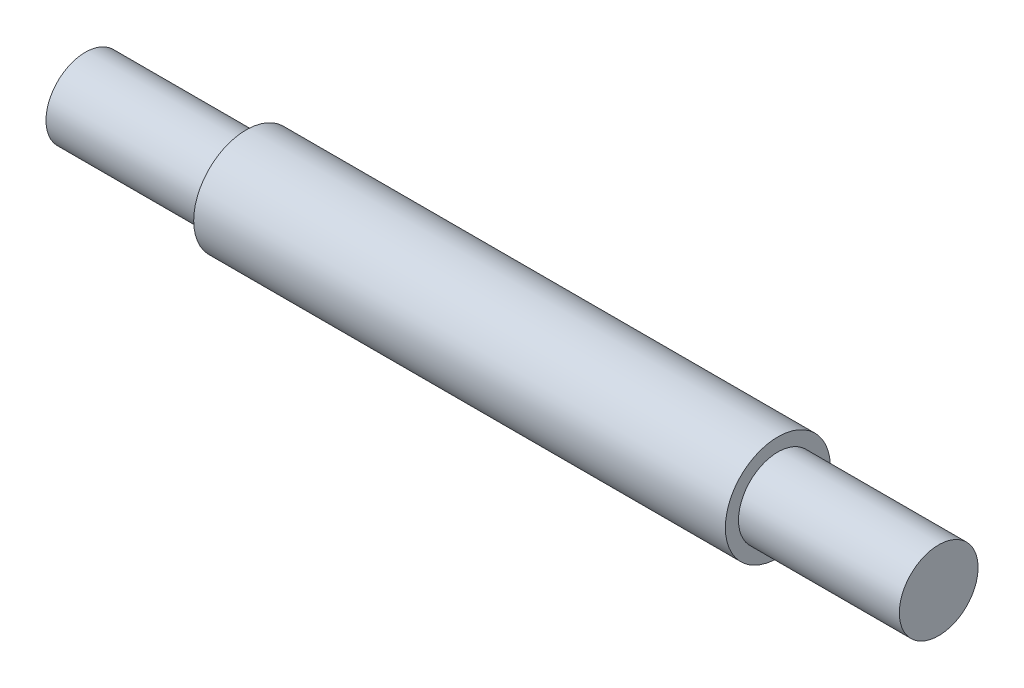
ISO-10303-21;
HEADER;
FILE_DESCRIPTION(('STEP AP214'),'2;1');
FILE_NAME('part.step','',(''),(''),'','','');
FILE_SCHEMA(('AUTOMOTIVE_DESIGN { 1 0 10303 214 1 1 1 1 }'));
ENDSEC;
DATA;
#1=APPLICATION_CONTEXT('core data for automotive mechanical design processes');
#2=APPLICATION_PROTOCOL_DEFINITION('international standard','automotive_design',2000,#1);
#3=PRODUCT_CONTEXT('',#1,'mechanical');
#4=PRODUCT('Part','Part','',(#3));
#5=PRODUCT_RELATED_PRODUCT_CATEGORY('part','',(#4));
#6=PRODUCT_DEFINITION_FORMATION('','',#4);
#7=PRODUCT_DEFINITION_CONTEXT('part definition',#1,'design');
#8=PRODUCT_DEFINITION('design','',#6,#7);
#9=PRODUCT_DEFINITION_SHAPE('','',#8);
#10=(LENGTH_UNIT() NAMED_UNIT(*) SI_UNIT(.MILLI.,.METRE.));
#11=(NAMED_UNIT(*) PLANE_ANGLE_UNIT() SI_UNIT($,.RADIAN.));
#12=(NAMED_UNIT(*) SI_UNIT($,.STERADIAN.) SOLID_ANGLE_UNIT());
#13=UNCERTAINTY_MEASURE_WITH_UNIT(LENGTH_MEASURE(1.E-05),#10,'distance_accuracy_value','');
#14=(GEOMETRIC_REPRESENTATION_CONTEXT(3) GLOBAL_UNCERTAINTY_ASSIGNED_CONTEXT((#13)) GLOBAL_UNIT_ASSIGNED_CONTEXT((#10,
#11,#12)) REPRESENTATION_CONTEXT('',''));
#15=CARTESIAN_POINT('',(0.,0.,0.));
#16=DIRECTION('',(0.,0.,1.));
#17=DIRECTION('',(1.,0.,0.));
#18=AXIS2_PLACEMENT_3D('',#15,#16,#17);
#19=CARTESIAN_POINT('',(-65.,0.,0.));
#20=DIRECTION('',(-1.,0.,0.));
#21=DIRECTION('',(0.,0.,1.));
#22=AXIS2_PLACEMENT_3D('',#19,#20,#21);
#23=CYLINDRICAL_SURFACE('',#22,8.);
#24=CARTESIAN_POINT('',(-40.5,0.,0.));
#25=DIRECTION('',(-1.,0.,0.));
#26=DIRECTION('',(0.,0.,1.));
#27=AXIS2_PLACEMENT_3D('',#24,#25,#26);
#28=CIRCLE('',#27,7.99999999999999);
#29=CARTESIAN_POINT('',(-40.5,0.,7.99999999999999));
#30=VERTEX_POINT('',#29);
#31=EDGE_CURVE('E10',#30,#30,#28,.T.);
#32=ORIENTED_EDGE('',*,*,#31,.F.);
#33=EDGE_LOOP('',(#32));
#34=FACE_BOUND('',#33,.T.);
#35=CARTESIAN_POINT('',(40.5,0.,0.));
#36=DIRECTION('',(-1.,0.,0.));
#37=DIRECTION('',(0.,0.,1.));
#38=AXIS2_PLACEMENT_3D('',#35,#36,#37);
#39=CIRCLE('',#38,7.99999999999999);
#40=CARTESIAN_POINT('',(40.5,0.,7.99999999999999));
#41=VERTEX_POINT('',#40);
#42=EDGE_CURVE('E45',#41,#41,#39,.T.);
#43=ORIENTED_EDGE('',*,*,#42,.T.);
#44=EDGE_LOOP('',(#43));
#45=FACE_BOUND('',#44,.T.);
#46=ADVANCED_FACE('F31',(#34,#45),#23,.T.);
#47=CARTESIAN_POINT('',(-40.5,7.99999999999999,0.));
#48=DIRECTION('',(1.,0.,0.));
#49=DIRECTION('',(0.,0.,-1.));
#50=AXIS2_PLACEMENT_3D('',#47,#48,#49);
#51=PLANE('',#50);
#52=CARTESIAN_POINT('',(-40.5,0.,0.));
#53=DIRECTION('',(-1.,0.,0.));
#54=DIRECTION('',(0.,0.,1.));
#55=AXIS2_PLACEMENT_3D('',#52,#53,#54);
#56=CIRCLE('',#55,6.);
#57=CARTESIAN_POINT('',(-40.5,0.,6.));
#58=VERTEX_POINT('',#57);
#59=EDGE_CURVE('E37',#58,#58,#56,.T.);
#60=ORIENTED_EDGE('',*,*,#59,.F.);
#61=EDGE_LOOP('',(#60));
#62=FACE_BOUND('',#61,.T.);
#63=ORIENTED_EDGE('',*,*,#31,.T.);
#64=EDGE_LOOP('',(#63));
#65=FACE_BOUND('',#64,.T.);
#66=ADVANCED_FACE('F69',(#62,#65),#51,.F.);
#67=CARTESIAN_POINT('',(-65.,0.,0.));
#68=DIRECTION('',(-1.,0.,0.));
#69=DIRECTION('',(0.,0.,1.));
#70=AXIS2_PLACEMENT_3D('',#67,#68,#69);
#71=CYLINDRICAL_SURFACE('',#70,6.);
#72=CARTESIAN_POINT('',(-65.,0.,0.));
#73=DIRECTION('',(-1.,0.,0.));
#74=DIRECTION('',(0.,0.,1.));
#75=AXIS2_PLACEMENT_3D('',#72,#73,#74);
#76=CIRCLE('',#75,6.);
#77=CARTESIAN_POINT('',(-65.,0.,6.));
#78=VERTEX_POINT('',#77);
#79=EDGE_CURVE('E41',#78,#78,#76,.T.);
#80=ORIENTED_EDGE('',*,*,#79,.F.);
#81=EDGE_LOOP('',(#80));
#82=FACE_BOUND('',#81,.T.);
#83=ORIENTED_EDGE('',*,*,#59,.T.);
#84=EDGE_LOOP('',(#83));
#85=FACE_BOUND('',#84,.T.);
#86=ADVANCED_FACE('F74',(#82,#85),#71,.T.);
#87=CARTESIAN_POINT('',(-65.,6.,0.));
#88=DIRECTION('',(1.,0.,0.));
#89=DIRECTION('',(0.,0.,-1.));
#90=AXIS2_PLACEMENT_3D('',#87,#88,#89);
#91=PLANE('',#90);
#92=ORIENTED_EDGE('',*,*,#79,.T.);
#93=EDGE_LOOP('',(#92));
#94=FACE_BOUND('',#93,.T.);
#95=ADVANCED_FACE('F80',(#94),#91,.F.);
#96=CARTESIAN_POINT('',(40.5,7.99999999999999,0.));
#97=DIRECTION('',(-1.,0.,0.));
#98=DIRECTION('',(0.,0.,-1.));
#99=AXIS2_PLACEMENT_3D('',#96,#97,#98);
#100=PLANE('',#99);
#101=CARTESIAN_POINT('',(40.5,0.,0.));
#102=DIRECTION('',(-1.,0.,0.));
#103=DIRECTION('',(0.,0.,1.));
#104=AXIS2_PLACEMENT_3D('',#101,#102,#103);
#105=CIRCLE('',#104,6.);
#106=CARTESIAN_POINT('',(40.5,0.,6.));
#107=VERTEX_POINT('',#106);
#108=EDGE_CURVE('E50',#107,#107,#105,.T.);
#109=ORIENTED_EDGE('',*,*,#108,.T.);
#110=EDGE_LOOP('',(#109));
#111=FACE_BOUND('',#110,.T.);
#112=ORIENTED_EDGE('',*,*,#42,.F.);
#113=EDGE_LOOP('',(#112));
#114=FACE_BOUND('',#113,.T.);
#115=ADVANCED_FACE('F66',(#111,#114),#100,.F.);
#116=CARTESIAN_POINT('',(65.,0.,0.));
#117=DIRECTION('',(1.,0.,0.));
#118=DIRECTION('',(0.,0.,1.));
#119=AXIS2_PLACEMENT_3D('',#116,#117,#118);
#120=CYLINDRICAL_SURFACE('',#119,6.);
#121=CARTESIAN_POINT('',(65.,0.,0.));
#122=DIRECTION('',(-1.,0.,0.));
#123=DIRECTION('',(0.,0.,1.));
#124=AXIS2_PLACEMENT_3D('',#121,#122,#123);
#125=CIRCLE('',#124,6.);
#126=CARTESIAN_POINT('',(65.,0.,6.));
#127=VERTEX_POINT('',#126);
#128=EDGE_CURVE('E53',#127,#127,#125,.T.);
#129=ORIENTED_EDGE('',*,*,#128,.T.);
#130=EDGE_LOOP('',(#129));
#131=FACE_BOUND('',#130,.T.);
#132=ORIENTED_EDGE('',*,*,#108,.F.);
#133=EDGE_LOOP('',(#132));
#134=FACE_BOUND('',#133,.T.);
#135=ADVANCED_FACE('F57',(#131,#134),#120,.T.);
#136=CARTESIAN_POINT('',(65.,6.,0.));
#137=DIRECTION('',(-1.,0.,0.));
#138=DIRECTION('',(0.,0.,-1.));
#139=AXIS2_PLACEMENT_3D('',#136,#137,#138);
#140=PLANE('',#139);
#141=ORIENTED_EDGE('',*,*,#128,.F.);
#142=EDGE_LOOP('',(#141));
#143=FACE_BOUND('',#142,.T.);
#144=ADVANCED_FACE('F60',(#143),#140,.F.);
#145=CLOSED_SHELL('',(#46,#66,#86,#95,#115,#135,#144));
#146=MANIFOLD_SOLID_BREP('B2',#145);
#147=ADVANCED_BREP_SHAPE_REPRESENTATION('',(#18,#146),#14);
#148=SHAPE_DEFINITION_REPRESENTATION(#9,#147);
ENDSEC;
END-ISO-10303-21;
